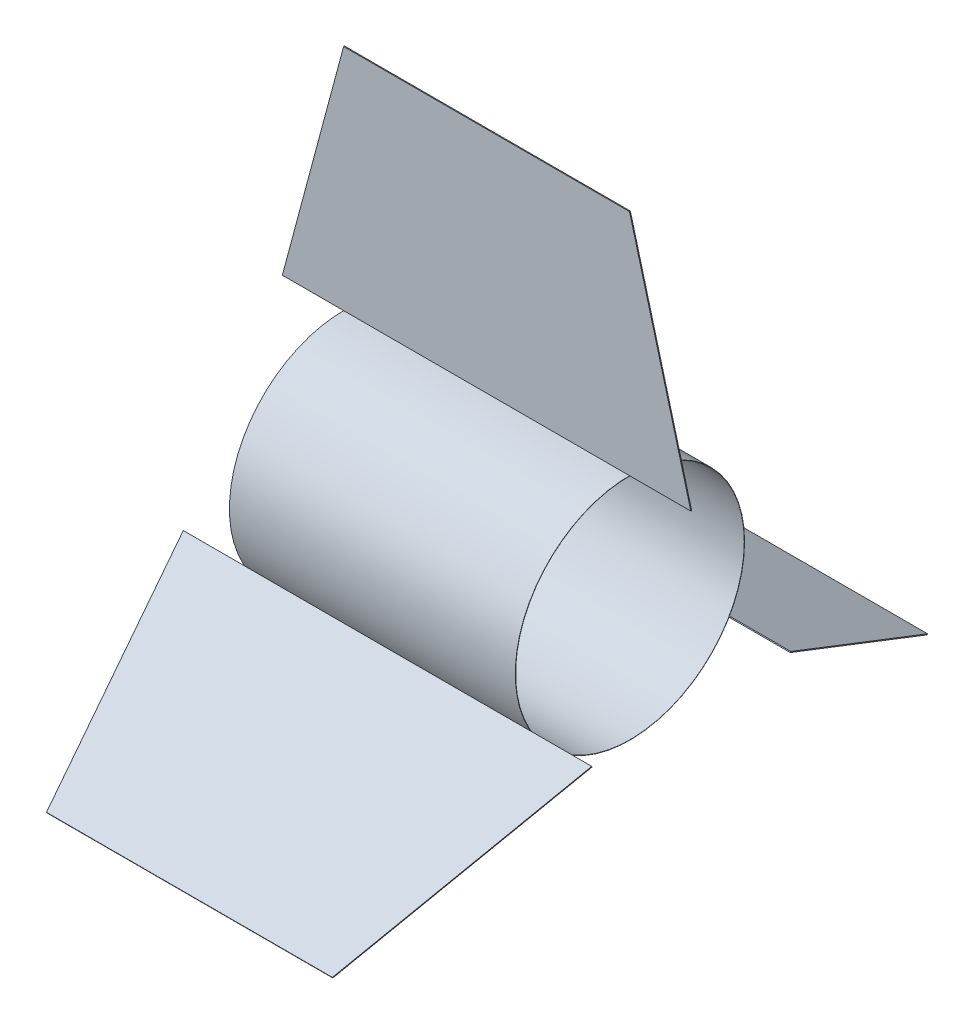
ISO-10303-21;
HEADER;
FILE_DESCRIPTION(('STEP AP214'),'2;1');
FILE_NAME('part.step','',(''),(''),'','','');
FILE_SCHEMA(('AUTOMOTIVE_DESIGN { 1 0 10303 214 1 1 1 1 }'));
ENDSEC;
DATA;
#1=APPLICATION_CONTEXT('core data for automotive mechanical design processes');
#2=APPLICATION_PROTOCOL_DEFINITION('international standard','automotive_design',2000,#1);
#3=PRODUCT_CONTEXT('',#1,'mechanical');
#4=PRODUCT('Part','Part','',(#3));
#5=PRODUCT_RELATED_PRODUCT_CATEGORY('part','',(#4));
#6=PRODUCT_DEFINITION_FORMATION('','',#4);
#7=PRODUCT_DEFINITION_CONTEXT('part definition',#1,'design');
#8=PRODUCT_DEFINITION('design','',#6,#7);
#9=PRODUCT_DEFINITION_SHAPE('','',#8);
#10=(LENGTH_UNIT() NAMED_UNIT(*) SI_UNIT(.MILLI.,.METRE.));
#11=(NAMED_UNIT(*) PLANE_ANGLE_UNIT() SI_UNIT($,.RADIAN.));
#12=(NAMED_UNIT(*) SI_UNIT($,.STERADIAN.) SOLID_ANGLE_UNIT());
#13=UNCERTAINTY_MEASURE_WITH_UNIT(LENGTH_MEASURE(1.E-05),#10,'distance_accuracy_value','');
#14=(GEOMETRIC_REPRESENTATION_CONTEXT(3) GLOBAL_UNCERTAINTY_ASSIGNED_CONTEXT((#13)) GLOBAL_UNIT_ASSIGNED_CONTEXT((#10,
#11,#12)) REPRESENTATION_CONTEXT('',''));
#15=CARTESIAN_POINT('',(0.,0.,0.));
#16=DIRECTION('',(0.,0.,1.));
#17=DIRECTION('',(1.,0.,0.));
#18=AXIS2_PLACEMENT_3D('',#15,#16,#17);
#19=CARTESIAN_POINT('',(-54.4472759020027,-50.5832961678722,-88.4065889770606));
#20=DIRECTION('',(0.,-0.499999999999992,-0.866025403784443));
#21=DIRECTION('',(-1.,0.,0.));
#22=AXIS2_PLACEMENT_3D('',#19,#20,#21);
#23=PLANE('',#22);
#24=DIRECTION('',(1.,0.,0.));
#25=VECTOR('',#24,1.);
#26=CARTESIAN_POINT('',(-54.4472759020027,-51.2707038321261,-88.0097139770606));
#27=LINE('',#26,#25);
#28=CARTESIAN_POINT('',(-54.4472759020027,-51.2707038321261,-88.0097139770606));
#29=VERTEX_POINT('',#28);
#30=CARTESIAN_POINT('',(308.447275902003,-51.2707038321261,-88.0097139770607));
#31=VERTEX_POINT('',#30);
#32=EDGE_CURVE('E125',#29,#31,#27,.T.);
#33=ORIENTED_EDGE('',*,*,#32,.T.);
#34=DIRECTION('',(0.,-0.866025403784443,0.499999999999992));
#35=VECTOR('',#34,1.);
#36=CARTESIAN_POINT('',(308.447275902003,-50.5832961678722,-88.4065889770607));
#37=LINE('',#36,#35);
#38=CARTESIAN_POINT('',(308.447275902003,-50.5832961678722,-88.4065889770607));
#39=VERTEX_POINT('',#38);
#40=EDGE_CURVE('E13',#39,#31,#37,.T.);
#41=ORIENTED_EDGE('',*,*,#40,.F.);
#42=DIRECTION('',(1.,0.,0.));
#43=VECTOR('',#42,1.);
#44=CARTESIAN_POINT('',(-54.4472759020027,-50.5832961678722,-88.4065889770606));
#45=LINE('',#44,#43);
#46=CARTESIAN_POINT('',(-54.4472759020027,-50.5832961678722,-88.4065889770606));
#47=VERTEX_POINT('',#46);
#48=EDGE_CURVE('E113',#47,#39,#45,.T.);
#49=ORIENTED_EDGE('',*,*,#48,.F.);
#50=DIRECTION('',(0.,-0.866025403784443,0.499999999999992));
#51=VECTOR('',#50,1.);
#52=CARTESIAN_POINT('',(-54.4472759020027,-50.5832961678722,-88.4065889770606));
#53=LINE('',#52,#51);
#54=EDGE_CURVE('E121',#47,#29,#53,.T.);
#55=ORIENTED_EDGE('',*,*,#54,.T.);
#56=EDGE_LOOP('',(#33,#41,#49,#55));
#57=FACE_BOUND('',#56,.T.);
#58=ADVANCED_FACE('F62',(#57),#23,.F.);
#59=CARTESIAN_POINT('',(308.447275902003,-50.5832961678722,-88.4065889770607));
#60=DIRECTION('',(-0.96592582628907,0.129409522551255,0.224143868042009));
#61=DIRECTION('',(0.258819045102515,0.482962913144527,0.836516303737814));
#62=AXIS2_PLACEMENT_3D('',#59,#60,#61);
#63=PLANE('',#62);
#64=DIRECTION('',(-0.258819045102515,-0.482962913144527,-0.836516303737814));
#65=VECTOR('',#64,1.);
#66=CARTESIAN_POINT('',(308.447275902003,-51.2707038321261,-88.0097139770607));
#67=LINE('',#66,#65);
#68=CARTESIAN_POINT('',(254.,-152.870703832124,-263.98607602606));
#69=VERTEX_POINT('',#68);
#70=EDGE_CURVE('E117',#31,#69,#67,.T.);
#71=ORIENTED_EDGE('',*,*,#70,.T.);
#72=DIRECTION('',(0.,-0.866025403784443,0.499999999999992));
#73=VECTOR('',#72,1.);
#74=CARTESIAN_POINT('',(254.,-152.183296167871,-264.38295102606));
#75=LINE('',#74,#73);
#76=CARTESIAN_POINT('',(254.,-152.183296167871,-264.38295102606));
#77=VERTEX_POINT('',#76);
#78=EDGE_CURVE('E70',#77,#69,#75,.T.);
#79=ORIENTED_EDGE('',*,*,#78,.F.);
#80=DIRECTION('',(-0.258819045102515,-0.482962913144527,-0.836516303737814));
#81=VECTOR('',#80,1.);
#82=CARTESIAN_POINT('',(308.447275902003,-50.5832961678722,-88.4065889770607));
#83=LINE('',#82,#81);
#84=EDGE_CURVE('E108',#39,#77,#83,.T.);
#85=ORIENTED_EDGE('',*,*,#84,.F.);
#86=ORIENTED_EDGE('',*,*,#40,.T.);
#87=EDGE_LOOP('',(#71,#79,#85,#86));
#88=FACE_BOUND('',#87,.T.);
#89=ADVANCED_FACE('F116',(#88),#63,.F.);
#90=CARTESIAN_POINT('',(254.,-152.183296167871,-264.38295102606));
#91=DIRECTION('',(0.,0.499999999999992,0.866025403784443));
#92=DIRECTION('',(1.,0.,0.));
#93=AXIS2_PLACEMENT_3D('',#90,#91,#92);
#94=PLANE('',#93);
#95=DIRECTION('',(-1.,0.,0.));
#96=VECTOR('',#95,1.);
#97=CARTESIAN_POINT('',(254.,-152.870703832124,-263.98607602606));
#98=LINE('',#97,#96);
#99=CARTESIAN_POINT('',(0.,-152.870703832124,-263.986076026059));
#100=VERTEX_POINT('',#99);
#101=EDGE_CURVE('E95',#69,#100,#98,.T.);
#102=ORIENTED_EDGE('',*,*,#101,.T.);
#103=DIRECTION('',(0.,-0.866025403784443,0.499999999999992));
#104=VECTOR('',#103,1.);
#105=CARTESIAN_POINT('',(0.,-152.183296167871,-264.382951026059));
#106=LINE('',#105,#104);
#107=CARTESIAN_POINT('',(0.,-152.183296167871,-264.382951026059));
#108=VERTEX_POINT('',#107);
#109=EDGE_CURVE('E118',#108,#100,#106,.T.);
#110=ORIENTED_EDGE('',*,*,#109,.F.);
#111=DIRECTION('',(-1.,0.,0.));
#112=VECTOR('',#111,1.);
#113=CARTESIAN_POINT('',(254.,-152.183296167871,-264.38295102606));
#114=LINE('',#113,#112);
#115=EDGE_CURVE('E111',#77,#108,#114,.T.);
#116=ORIENTED_EDGE('',*,*,#115,.F.);
#117=ORIENTED_EDGE('',*,*,#78,.T.);
#118=EDGE_LOOP('',(#102,#110,#116,#117));
#119=FACE_BOUND('',#118,.T.);
#120=ADVANCED_FACE('F119',(#119),#94,.F.);
#121=CARTESIAN_POINT('',(0.,-152.183296167871,-264.382951026059));
#122=DIRECTION('',(0.96592582628907,0.129409522551255,0.224143868042009));
#123=DIRECTION('',(0.258819045102514,-0.482962913144527,-0.836516303737814));
#124=AXIS2_PLACEMENT_3D('',#121,#122,#123);
#125=PLANE('',#124);
#126=DIRECTION('',(-0.258819045102514,0.482962913144527,0.836516303737814));
#127=VECTOR('',#126,1.);
#128=CARTESIAN_POINT('',(0.,-152.870703832124,-263.986076026059));
#129=LINE('',#128,#127);
#130=EDGE_CURVE('E101',#100,#29,#129,.T.);
#131=ORIENTED_EDGE('',*,*,#130,.T.);
#132=ORIENTED_EDGE('',*,*,#54,.F.);
#133=DIRECTION('',(-0.258819045102514,0.482962913144527,0.836516303737814));
#134=VECTOR('',#133,1.);
#135=CARTESIAN_POINT('',(0.,-152.183296167871,-264.382951026059));
#136=LINE('',#135,#134);
#137=EDGE_CURVE('E78',#108,#47,#136,.T.);
#138=ORIENTED_EDGE('',*,*,#137,.F.);
#139=ORIENTED_EDGE('',*,*,#109,.T.);
#140=EDGE_LOOP('',(#131,#132,#138,#139));
#141=FACE_BOUND('',#140,.T.);
#142=ADVANCED_FACE('F132',(#141),#125,.F.);
#143=CARTESIAN_POINT('',(0.,0.343703832126951,-0.198437499999997));
#144=DIRECTION('',(0.,0.866025403784443,-0.499999999999992));
#145=DIRECTION('',(1.,0.,0.));
#146=AXIS2_PLACEMENT_3D('',#143,#144,#145);
#147=PLANE('',#146);
#148=ORIENTED_EDGE('',*,*,#48,.T.);
#149=ORIENTED_EDGE('',*,*,#84,.T.);
#150=ORIENTED_EDGE('',*,*,#115,.T.);
#151=ORIENTED_EDGE('',*,*,#137,.T.);
#152=EDGE_LOOP('',(#148,#149,#150,#151));
#153=FACE_BOUND('',#152,.T.);
#154=ADVANCED_FACE('F109',(#153),#147,.T.);
#155=CARTESIAN_POINT('',(0.,-0.343703832126951,0.198437499999997));
#156=DIRECTION('',(0.,0.866025403784443,-0.499999999999992));
#157=DIRECTION('',(1.,0.,0.));
#158=AXIS2_PLACEMENT_3D('',#155,#156,#157);
#159=PLANE('',#158);
#160=ORIENTED_EDGE('',*,*,#32,.F.);
#161=ORIENTED_EDGE('',*,*,#130,.F.);
#162=ORIENTED_EDGE('',*,*,#101,.F.);
#163=ORIENTED_EDGE('',*,*,#70,.F.);
#164=EDGE_LOOP('',(#160,#161,#162,#163));
#165=FACE_BOUND('',#164,.T.);
#166=ADVANCED_FACE('F135',(#165),#159,.F.);
#167=CLOSED_SHELL('',(#58,#89,#120,#142,#154,#166));
#168=MANIFOLD_SOLID_BREP('B2',#167);
#169=CARTESIAN_POINT('',(-54.4472759020027,-51.2707038321273,88.0097139770599));
#170=DIRECTION('',(0.,-0.500000000000004,0.866025403784436));
#171=DIRECTION('',(-1.,0.,0.));
#172=AXIS2_PLACEMENT_3D('',#169,#170,#171);
#173=PLANE('',#172);
#174=DIRECTION('',(1.,0.,0.));
#175=VECTOR('',#174,1.);
#176=CARTESIAN_POINT('',(-54.4472759020027,-50.5832961678734,88.4065889770599));
#177=LINE('',#176,#175);
#178=CARTESIAN_POINT('',(-54.4472759020027,-50.5832961678734,88.4065889770599));
#179=VERTEX_POINT('',#178);
#180=CARTESIAN_POINT('',(308.447275902003,-50.5832961678734,88.40658897706));
#181=VERTEX_POINT('',#180);
#182=EDGE_CURVE('E283',#179,#181,#177,.T.);
#183=ORIENTED_EDGE('',*,*,#182,.T.);
#184=DIRECTION('',(0.,0.866025403784436,0.500000000000004));
#185=VECTOR('',#184,1.);
#186=CARTESIAN_POINT('',(308.447275902003,-51.2707038321274,88.00971397706));
#187=LINE('',#186,#185);
#188=CARTESIAN_POINT('',(308.447275902003,-51.2707038321274,88.00971397706));
#189=VERTEX_POINT('',#188);
#190=EDGE_CURVE('E60',#189,#181,#187,.T.);
#191=ORIENTED_EDGE('',*,*,#190,.F.);
#192=DIRECTION('',(1.,0.,0.));
#193=VECTOR('',#192,1.);
#194=CARTESIAN_POINT('',(-54.4472759020027,-51.2707038321273,88.0097139770599));
#195=LINE('',#194,#193);
#196=CARTESIAN_POINT('',(-54.4472759020027,-51.2707038321273,88.0097139770599));
#197=VERTEX_POINT('',#196);
#198=EDGE_CURVE('E271',#197,#189,#195,.T.);
#199=ORIENTED_EDGE('',*,*,#198,.F.);
#200=DIRECTION('',(0.,0.866025403784436,0.500000000000004));
#201=VECTOR('',#200,1.);
#202=CARTESIAN_POINT('',(-54.4472759020027,-51.2707038321273,88.0097139770599));
#203=LINE('',#202,#201);
#204=EDGE_CURVE('E279',#197,#179,#203,.T.);
#205=ORIENTED_EDGE('',*,*,#204,.T.);
#206=EDGE_LOOP('',(#183,#191,#199,#205));
#207=FACE_BOUND('',#206,.T.);
#208=ADVANCED_FACE('F220',(#207),#173,.F.);
#209=CARTESIAN_POINT('',(308.447275902003,-51.2707038321274,88.00971397706));
#210=DIRECTION('',(-0.96592582628907,0.129409522551258,-0.224143868042008));
#211=DIRECTION('',(0.258819045102515,0.482962913144539,-0.836516303737807));
#212=AXIS2_PLACEMENT_3D('',#209,#210,#211);
#213=PLANE('',#212);
#214=DIRECTION('',(-0.258819045102515,-0.482962913144539,0.836516303737807));
#215=VECTOR('',#214,1.);
#216=CARTESIAN_POINT('',(308.447275902003,-50.5832961678734,88.40658897706));
#217=LINE('',#216,#215);
#218=CARTESIAN_POINT('',(254.,-152.183296167874,264.382951026057));
#219=VERTEX_POINT('',#218);
#220=EDGE_CURVE('E275',#181,#219,#217,.T.);
#221=ORIENTED_EDGE('',*,*,#220,.T.);
#222=DIRECTION('',(0.,0.866025403784436,0.500000000000004));
#223=VECTOR('',#222,1.);
#224=CARTESIAN_POINT('',(254.,-152.870703832128,263.986076026058));
#225=LINE('',#224,#223);
#226=CARTESIAN_POINT('',(254.,-152.870703832128,263.986076026058));
#227=VERTEX_POINT('',#226);
#228=EDGE_CURVE('E228',#227,#219,#225,.T.);
#229=ORIENTED_EDGE('',*,*,#228,.F.);
#230=DIRECTION('',(-0.258819045102515,-0.482962913144539,0.836516303737807));
#231=VECTOR('',#230,1.);
#232=CARTESIAN_POINT('',(308.447275902003,-51.2707038321274,88.00971397706));
#233=LINE('',#232,#231);
#234=EDGE_CURVE('E266',#189,#227,#233,.T.);
#235=ORIENTED_EDGE('',*,*,#234,.F.);
#236=ORIENTED_EDGE('',*,*,#190,.T.);
#237=EDGE_LOOP('',(#221,#229,#235,#236));
#238=FACE_BOUND('',#237,.T.);
#239=ADVANCED_FACE('F274',(#238),#213,.F.);
#240=CARTESIAN_POINT('',(254.,-152.870703832128,263.986076026058));
#241=DIRECTION('',(0.,0.500000000000004,-0.866025403784436));
#242=DIRECTION('',(1.,0.,0.));
#243=AXIS2_PLACEMENT_3D('',#240,#241,#242);
#244=PLANE('',#243);
#245=DIRECTION('',(-1.,0.,0.));
#246=VECTOR('',#245,1.);
#247=CARTESIAN_POINT('',(254.,-152.183296167874,264.382951026057));
#248=LINE('',#247,#246);
#249=CARTESIAN_POINT('',(0.,-152.183296167874,264.382951026057));
#250=VERTEX_POINT('',#249);
#251=EDGE_CURVE('E253',#219,#250,#248,.T.);
#252=ORIENTED_EDGE('',*,*,#251,.T.);
#253=DIRECTION('',(0.,0.866025403784436,0.500000000000004));
#254=VECTOR('',#253,1.);
#255=CARTESIAN_POINT('',(0.,-152.870703832128,263.986076026057));
#256=LINE('',#255,#254);
#257=CARTESIAN_POINT('',(0.,-152.870703832128,263.986076026057));
#258=VERTEX_POINT('',#257);
#259=EDGE_CURVE('E276',#258,#250,#256,.T.);
#260=ORIENTED_EDGE('',*,*,#259,.F.);
#261=DIRECTION('',(-1.,0.,0.));
#262=VECTOR('',#261,1.);
#263=CARTESIAN_POINT('',(254.,-152.870703832128,263.986076026058));
#264=LINE('',#263,#262);
#265=EDGE_CURVE('E269',#227,#258,#264,.T.);
#266=ORIENTED_EDGE('',*,*,#265,.F.);
#267=ORIENTED_EDGE('',*,*,#228,.T.);
#268=EDGE_LOOP('',(#252,#260,#266,#267));
#269=FACE_BOUND('',#268,.T.);
#270=ADVANCED_FACE('F277',(#269),#244,.F.);
#271=CARTESIAN_POINT('',(0.,-152.870703832128,263.986076026057));
#272=DIRECTION('',(0.96592582628907,0.129409522551258,-0.224143868042007));
#273=DIRECTION('',(0.258819045102514,-0.482962913144539,0.836516303737807));
#274=AXIS2_PLACEMENT_3D('',#271,#272,#273);
#275=PLANE('',#274);
#276=DIRECTION('',(-0.258819045102514,0.482962913144539,-0.836516303737807));
#277=VECTOR('',#276,1.);
#278=CARTESIAN_POINT('',(0.,-152.183296167874,264.382951026057));
#279=LINE('',#278,#277);
#280=EDGE_CURVE('E259',#250,#179,#279,.T.);
#281=ORIENTED_EDGE('',*,*,#280,.T.);
#282=ORIENTED_EDGE('',*,*,#204,.F.);
#283=DIRECTION('',(-0.258819045102514,0.482962913144539,-0.836516303737807));
#284=VECTOR('',#283,1.);
#285=CARTESIAN_POINT('',(0.,-152.870703832128,263.986076026057));
#286=LINE('',#285,#284);
#287=EDGE_CURVE('E236',#258,#197,#286,.T.);
#288=ORIENTED_EDGE('',*,*,#287,.F.);
#289=ORIENTED_EDGE('',*,*,#259,.T.);
#290=EDGE_LOOP('',(#281,#282,#288,#289));
#291=FACE_BOUND('',#290,.T.);
#292=ADVANCED_FACE('F290',(#291),#275,.F.);
#293=CARTESIAN_POINT('',(0.,-0.343703832126948,-0.198437500000002));
#294=DIRECTION('',(0.,-0.866025403784436,-0.500000000000004));
#295=DIRECTION('',(1.,0.,0.));
#296=AXIS2_PLACEMENT_3D('',#293,#294,#295);
#297=PLANE('',#296);
#298=ORIENTED_EDGE('',*,*,#198,.T.);
#299=ORIENTED_EDGE('',*,*,#234,.T.);
#300=ORIENTED_EDGE('',*,*,#265,.T.);
#301=ORIENTED_EDGE('',*,*,#287,.T.);
#302=EDGE_LOOP('',(#298,#299,#300,#301));
#303=FACE_BOUND('',#302,.T.);
#304=ADVANCED_FACE('F267',(#303),#297,.T.);
#305=CARTESIAN_POINT('',(0.,0.343703832126948,0.198437500000002));
#306=DIRECTION('',(0.,-0.866025403784436,-0.500000000000004));
#307=DIRECTION('',(1.,0.,0.));
#308=AXIS2_PLACEMENT_3D('',#305,#306,#307);
#309=PLANE('',#308);
#310=ORIENTED_EDGE('',*,*,#182,.F.);
#311=ORIENTED_EDGE('',*,*,#280,.F.);
#312=ORIENTED_EDGE('',*,*,#251,.F.);
#313=ORIENTED_EDGE('',*,*,#220,.F.);
#314=EDGE_LOOP('',(#310,#311,#312,#313));
#315=FACE_BOUND('',#314,.T.);
#316=ADVANCED_FACE('F293',(#315),#309,.F.);
#317=CLOSED_SHELL('',(#208,#239,#270,#292,#304,#316));
#318=MANIFOLD_SOLID_BREP('B7',#317);
#319=CARTESIAN_POINT('',(-54.4472759020027,101.854,0.396875));
#320=DIRECTION('',(0.,1.,0.));
#321=DIRECTION('',(-1.,0.,0.));
#322=AXIS2_PLACEMENT_3D('',#319,#320,#321);
#323=PLANE('',#322);
#324=DIRECTION('',(1.,0.,0.));
#325=VECTOR('',#324,1.);
#326=CARTESIAN_POINT('',(-54.4472759020027,101.854,-0.396875));
#327=LINE('',#326,#325);
#328=CARTESIAN_POINT('',(-54.4472759020027,101.854,-0.396875));
#329=VERTEX_POINT('',#328);
#330=CARTESIAN_POINT('',(308.447275902003,101.854,-0.396875));
#331=VERTEX_POINT('',#330);
#332=EDGE_CURVE('E443',#329,#331,#327,.T.);
#333=ORIENTED_EDGE('',*,*,#332,.T.);
#334=DIRECTION('',(0.,0.,-1.));
#335=VECTOR('',#334,1.);
#336=CARTESIAN_POINT('',(308.447275902003,101.854,0.396875));
#337=LINE('',#336,#335);
#338=CARTESIAN_POINT('',(308.447275902003,101.854,0.396875));
#339=VERTEX_POINT('',#338);
#340=EDGE_CURVE('E218',#339,#331,#337,.T.);
#341=ORIENTED_EDGE('',*,*,#340,.F.);
#342=DIRECTION('',(1.,0.,0.));
#343=VECTOR('',#342,1.);
#344=CARTESIAN_POINT('',(-54.4472759020027,101.854,0.396875));
#345=LINE('',#344,#343);
#346=CARTESIAN_POINT('',(-54.4472759020027,101.854,0.396875));
#347=VERTEX_POINT('',#346);
#348=EDGE_CURVE('E427',#347,#339,#345,.T.);
#349=ORIENTED_EDGE('',*,*,#348,.F.);
#350=DIRECTION('',(0.,0.,-1.));
#351=VECTOR('',#350,1.);
#352=CARTESIAN_POINT('',(-54.4472759020027,101.854,0.396875));
#353=LINE('',#352,#351);
#354=EDGE_CURVE('E439',#347,#329,#353,.T.);
#355=ORIENTED_EDGE('',*,*,#354,.T.);
#356=EDGE_LOOP('',(#333,#341,#349,#355));
#357=FACE_BOUND('',#356,.T.);
#358=ADVANCED_FACE('F375',(#357),#323,.F.);
#359=CARTESIAN_POINT('',(308.447275902003,101.854,0.396875));
#360=DIRECTION('',(-0.96592582628907,-0.258819045102515,0.));
#361=DIRECTION('',(0.258819045102515,-0.96592582628907,0.));
#362=AXIS2_PLACEMENT_3D('',#359,#360,#361);
#363=PLANE('',#362);
#364=DIRECTION('',(-0.258819045102515,0.96592582628907,0.));
#365=VECTOR('',#364,1.);
#366=CARTESIAN_POINT('',(308.447275902003,101.854,-0.396875));
#367=LINE('',#366,#365);
#368=CARTESIAN_POINT('',(254.,305.054,-0.396875));
#369=VERTEX_POINT('',#368);
#370=EDGE_CURVE('E432',#331,#369,#367,.T.);
#371=ORIENTED_EDGE('',*,*,#370,.T.);
#372=DIRECTION('',(0.,0.,-1.));
#373=VECTOR('',#372,1.);
#374=CARTESIAN_POINT('',(254.,305.054,0.396875));
#375=LINE('',#374,#373);
#376=CARTESIAN_POINT('',(254.,305.054,0.396875));
#377=VERTEX_POINT('',#376);
#378=EDGE_CURVE('E384',#377,#369,#375,.T.);
#379=ORIENTED_EDGE('',*,*,#378,.F.);
#380=DIRECTION('',(-0.258819045102515,0.96592582628907,0.));
#381=VECTOR('',#380,1.);
#382=CARTESIAN_POINT('',(308.447275902003,101.854,0.396875));
#383=LINE('',#382,#381);
#384=EDGE_CURVE('E422',#339,#377,#383,.T.);
#385=ORIENTED_EDGE('',*,*,#384,.F.);
#386=ORIENTED_EDGE('',*,*,#340,.T.);
#387=EDGE_LOOP('',(#371,#379,#385,#386));
#388=FACE_BOUND('',#387,.T.);
#389=ADVANCED_FACE('F431',(#388),#363,.F.);
#390=CARTESIAN_POINT('',(254.,305.054,0.396875));
#391=DIRECTION('',(0.,-1.,0.));
#392=DIRECTION('',(1.,0.,0.));
#393=AXIS2_PLACEMENT_3D('',#390,#391,#392);
#394=PLANE('',#393);
#395=DIRECTION('',(-1.,0.,0.));
#396=VECTOR('',#395,1.);
#397=CARTESIAN_POINT('',(254.,305.054,-0.396875));
#398=LINE('',#397,#396);
#399=CARTESIAN_POINT('',(0.,305.054,-0.396875));
#400=VERTEX_POINT('',#399);
#401=EDGE_CURVE('E409',#369,#400,#398,.T.);
#402=ORIENTED_EDGE('',*,*,#401,.T.);
#403=DIRECTION('',(0.,0.,-1.));
#404=VECTOR('',#403,1.);
#405=CARTESIAN_POINT('',(0.,305.054,0.396875));
#406=LINE('',#405,#404);
#407=CARTESIAN_POINT('',(0.,305.054,0.396875));
#408=VERTEX_POINT('',#407);
#409=EDGE_CURVE('E434',#408,#400,#406,.T.);
#410=ORIENTED_EDGE('',*,*,#409,.F.);
#411=DIRECTION('',(-1.,0.,0.));
#412=VECTOR('',#411,1.);
#413=CARTESIAN_POINT('',(254.,305.054,0.396875));
#414=LINE('',#413,#412);
#415=EDGE_CURVE('E425',#377,#408,#414,.T.);
#416=ORIENTED_EDGE('',*,*,#415,.F.);
#417=ORIENTED_EDGE('',*,*,#378,.T.);
#418=EDGE_LOOP('',(#402,#410,#416,#417));
#419=FACE_BOUND('',#418,.T.);
#420=ADVANCED_FACE('F435',(#419),#394,.F.);
#421=CARTESIAN_POINT('',(0.,305.054,0.396875));
#422=DIRECTION('',(0.96592582628907,-0.258819045102514,0.));
#423=DIRECTION('',(0.258819045102514,0.96592582628907,0.));
#424=AXIS2_PLACEMENT_3D('',#421,#422,#423);
#425=PLANE('',#424);
#426=DIRECTION('',(-0.258819045102514,-0.96592582628907,0.));
#427=VECTOR('',#426,1.);
#428=CARTESIAN_POINT('',(0.,305.054,-0.396875));
#429=LINE('',#428,#427);
#430=EDGE_CURVE('E415',#400,#329,#429,.T.);
#431=ORIENTED_EDGE('',*,*,#430,.T.);
#432=ORIENTED_EDGE('',*,*,#354,.F.);
#433=DIRECTION('',(-0.258819045102514,-0.96592582628907,0.));
#434=VECTOR('',#433,1.);
#435=CARTESIAN_POINT('',(0.,305.054,0.396875));
#436=LINE('',#435,#434);
#437=EDGE_CURVE('E392',#408,#347,#436,.T.);
#438=ORIENTED_EDGE('',*,*,#437,.F.);
#439=ORIENTED_EDGE('',*,*,#409,.T.);
#440=EDGE_LOOP('',(#431,#432,#438,#439));
#441=FACE_BOUND('',#440,.T.);
#442=ADVANCED_FACE('F456',(#441),#425,.F.);
#443=CARTESIAN_POINT('',(0.,0.,0.396875));
#444=DIRECTION('',(0.,0.,1.));
#445=DIRECTION('',(1.,0.,0.));
#446=AXIS2_PLACEMENT_3D('',#443,#444,#445);
#447=PLANE('',#446);
#448=ORIENTED_EDGE('',*,*,#348,.T.);
#449=ORIENTED_EDGE('',*,*,#384,.T.);
#450=ORIENTED_EDGE('',*,*,#415,.T.);
#451=ORIENTED_EDGE('',*,*,#437,.T.);
#452=EDGE_LOOP('',(#448,#449,#450,#451));
#453=FACE_BOUND('',#452,.T.);
#454=ADVANCED_FACE('F423',(#453),#447,.T.);
#455=CARTESIAN_POINT('',(0.,0.,-0.396875));
#456=DIRECTION('',(0.,0.,1.));
#457=DIRECTION('',(1.,0.,0.));
#458=AXIS2_PLACEMENT_3D('',#455,#456,#457);
#459=PLANE('',#458);
#460=ORIENTED_EDGE('',*,*,#332,.F.);
#461=ORIENTED_EDGE('',*,*,#430,.F.);
#462=ORIENTED_EDGE('',*,*,#401,.F.);
#463=ORIENTED_EDGE('',*,*,#370,.F.);
#464=EDGE_LOOP('',(#460,#461,#462,#463));
#465=FACE_BOUND('',#464,.T.);
#466=ADVANCED_FACE('F459',(#465),#459,.F.);
#467=CLOSED_SHELL('',(#358,#389,#420,#442,#454,#466));
#468=MANIFOLD_SOLID_BREP('B54',#467);
#469=CARTESIAN_POINT('',(254.,0.,0.));
#470=DIRECTION('',(1.,0.,0.));
#471=DIRECTION('',(0.,0.,-1.));
#472=AXIS2_PLACEMENT_3D('',#469,#470,#471);
#473=PLANE('',#472);
#474=CARTESIAN_POINT('',(254.,0.,0.));
#475=DIRECTION('',(1.,0.,0.));
#476=DIRECTION('',(0.,0.,-1.));
#477=AXIS2_PLACEMENT_3D('',#474,#475,#476);
#478=CIRCLE('',#477,101.854);
#479=CARTESIAN_POINT('',(254.,0.,-101.854));
#480=VERTEX_POINT('',#479);
#481=EDGE_CURVE('E374',#480,#480,#478,.T.);
#482=ORIENTED_EDGE('',*,*,#481,.T.);
#483=EDGE_LOOP('',(#482));
#484=FACE_BOUND('',#483,.T.);
#485=CARTESIAN_POINT('',(254.,0.,0.));
#486=DIRECTION('',(1.,0.,0.));
#487=DIRECTION('',(0.,0.,-1.));
#488=AXIS2_PLACEMENT_3D('',#485,#486,#487);
#489=CIRCLE('',#488,101.6);
#490=CARTESIAN_POINT('',(254.,0.,-101.6));
#491=VERTEX_POINT('',#490);
#492=EDGE_CURVE('E538',#491,#491,#489,.T.);
#493=ORIENTED_EDGE('',*,*,#492,.F.);
#494=EDGE_LOOP('',(#493));
#495=FACE_BOUND('',#494,.T.);
#496=ADVANCED_FACE('F527',(#484,#495),#473,.T.);
#497=CARTESIAN_POINT('',(0.,0.,0.));
#498=DIRECTION('',(1.,0.,0.));
#499=DIRECTION('',(0.,0.,-1.));
#500=AXIS2_PLACEMENT_3D('',#497,#498,#499);
#501=PLANE('',#500);
#502=CARTESIAN_POINT('',(0.,0.,0.));
#503=DIRECTION('',(1.,0.,0.));
#504=DIRECTION('',(0.,0.,-1.));
#505=AXIS2_PLACEMENT_3D('',#502,#503,#504);
#506=CIRCLE('',#505,101.854);
#507=CARTESIAN_POINT('',(0.,0.,-101.854));
#508=VERTEX_POINT('',#507);
#509=EDGE_CURVE('E531',#508,#508,#506,.T.);
#510=ORIENTED_EDGE('',*,*,#509,.F.);
#511=EDGE_LOOP('',(#510));
#512=FACE_BOUND('',#511,.T.);
#513=CARTESIAN_POINT('',(0.,0.,0.));
#514=DIRECTION('',(1.,0.,0.));
#515=DIRECTION('',(0.,0.,-1.));
#516=AXIS2_PLACEMENT_3D('',#513,#514,#515);
#517=CIRCLE('',#516,101.6);
#518=CARTESIAN_POINT('',(0.,0.,-101.6));
#519=VERTEX_POINT('',#518);
#520=EDGE_CURVE('E540',#519,#519,#517,.T.);
#521=ORIENTED_EDGE('',*,*,#520,.T.);
#522=EDGE_LOOP('',(#521));
#523=FACE_BOUND('',#522,.T.);
#524=ADVANCED_FACE('F550',(#512,#523),#501,.F.);
#525=CARTESIAN_POINT('',(254.,0.,0.));
#526=DIRECTION('',(-1.,0.,0.));
#527=DIRECTION('',(0.,0.,1.));
#528=AXIS2_PLACEMENT_3D('',#525,#526,#527);
#529=CYLINDRICAL_SURFACE('',#528,101.854);
#530=ORIENTED_EDGE('',*,*,#481,.F.);
#531=EDGE_LOOP('',(#530));
#532=FACE_BOUND('',#531,.T.);
#533=ORIENTED_EDGE('',*,*,#509,.T.);
#534=EDGE_LOOP('',(#533));
#535=FACE_BOUND('',#534,.T.);
#536=ADVANCED_FACE('F529',(#532,#535),#529,.T.);
#537=CARTESIAN_POINT('',(254.,0.,0.));
#538=DIRECTION('',(-1.,0.,0.));
#539=DIRECTION('',(0.,0.,1.));
#540=AXIS2_PLACEMENT_3D('',#537,#538,#539);
#541=CYLINDRICAL_SURFACE('',#540,101.6);
#542=ORIENTED_EDGE('',*,*,#492,.T.);
#543=EDGE_LOOP('',(#542));
#544=FACE_BOUND('',#543,.T.);
#545=ORIENTED_EDGE('',*,*,#520,.F.);
#546=EDGE_LOOP('',(#545));
#547=FACE_BOUND('',#546,.T.);
#548=ADVANCED_FACE('F546',(#544,#547),#541,.F.);
#549=CLOSED_SHELL('',(#496,#524,#536,#548));
#550=MANIFOLD_SOLID_BREP('B212',#549);
#551=ADVANCED_BREP_SHAPE_REPRESENTATION('',(#18,#168,#318,#468,#550),#14);
#552=SHAPE_DEFINITION_REPRESENTATION(#9,#551);
ENDSEC;
END-ISO-10303-21;
